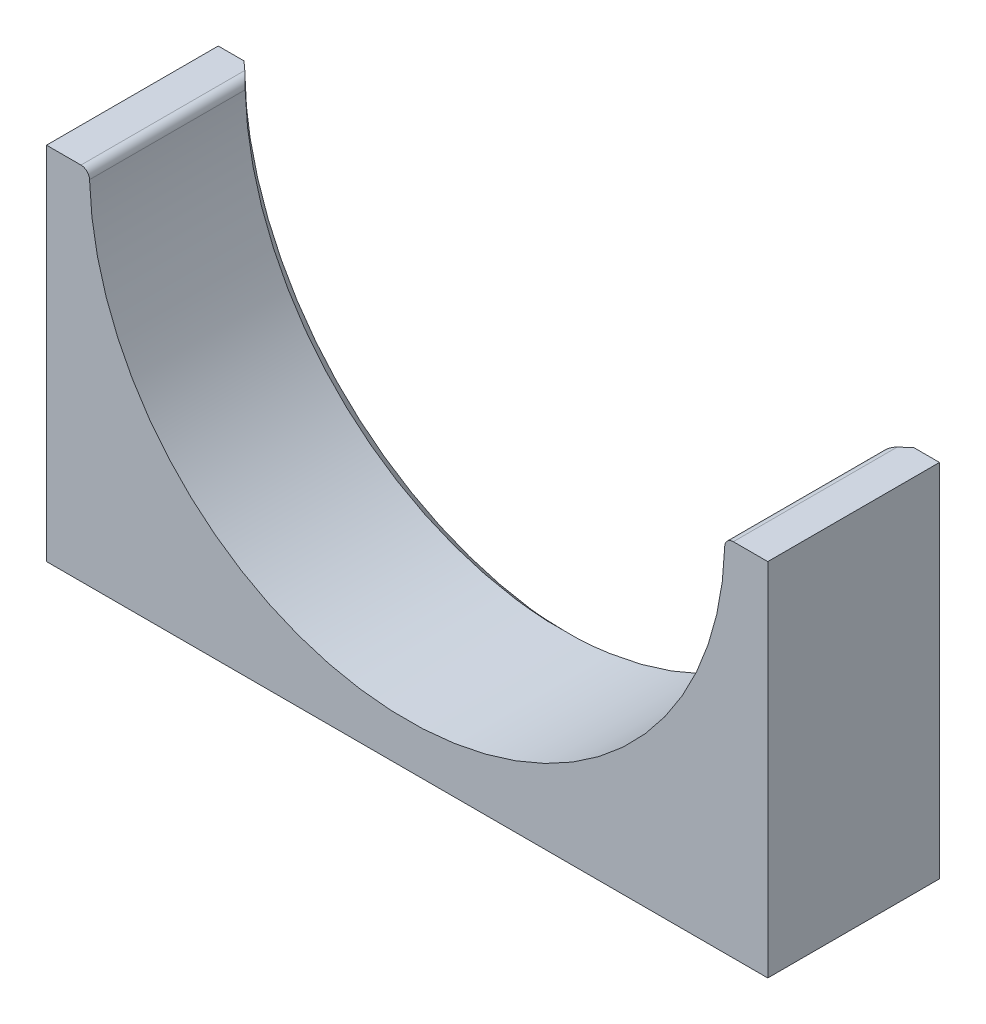
ISO-10303-21;
HEADER;
FILE_DESCRIPTION(('STEP AP214'),'2;1');
FILE_NAME('part.step','',(''),(''),'','','');
FILE_SCHEMA(('AUTOMOTIVE_DESIGN { 1 0 10303 214 1 1 1 1 }'));
ENDSEC;
DATA;
#1=APPLICATION_CONTEXT('core data for automotive mechanical design processes');
#2=APPLICATION_PROTOCOL_DEFINITION('international standard','automotive_design',2000,#1);
#3=PRODUCT_CONTEXT('',#1,'mechanical');
#4=PRODUCT('Part','Part','',(#3));
#5=PRODUCT_RELATED_PRODUCT_CATEGORY('part','',(#4));
#6=PRODUCT_DEFINITION_FORMATION('','',#4);
#7=PRODUCT_DEFINITION_CONTEXT('part definition',#1,'design');
#8=PRODUCT_DEFINITION('design','',#6,#7);
#9=PRODUCT_DEFINITION_SHAPE('','',#8);
#10=(LENGTH_UNIT() NAMED_UNIT(*) SI_UNIT(.MILLI.,.METRE.));
#11=(NAMED_UNIT(*) PLANE_ANGLE_UNIT() SI_UNIT($,.RADIAN.));
#12=(NAMED_UNIT(*) SI_UNIT($,.STERADIAN.) SOLID_ANGLE_UNIT());
#13=UNCERTAINTY_MEASURE_WITH_UNIT(LENGTH_MEASURE(1.E-05),#10,'distance_accuracy_value','');
#14=(GEOMETRIC_REPRESENTATION_CONTEXT(3) GLOBAL_UNCERTAINTY_ASSIGNED_CONTEXT((#13)) GLOBAL_UNIT_ASSIGNED_CONTEXT((#10,
#11,#12)) REPRESENTATION_CONTEXT('',''));
#15=CARTESIAN_POINT('',(0.,0.,0.));
#16=DIRECTION('',(0.,0.,1.));
#17=DIRECTION('',(1.,0.,0.));
#18=AXIS2_PLACEMENT_3D('',#15,#16,#17);
#19=CARTESIAN_POINT('',(106.68,-106.68,0.));
#20=DIRECTION('',(1.,0.,0.));
#21=DIRECTION('',(0.,0.,-1.));
#22=AXIS2_PLACEMENT_3D('',#19,#20,#21);
#23=PLANE('',#22);
#24=DIRECTION('',(0.,0.,-1.));
#25=VECTOR('',#24,1.);
#26=CARTESIAN_POINT('',(106.68,0.,0.));
#27=LINE('',#26,#25);
#28=CARTESIAN_POINT('',(106.68,0.,50.8));
#29=VERTEX_POINT('',#28);
#30=CARTESIAN_POINT('',(106.68,0.,0.));
#31=VERTEX_POINT('',#30);
#32=EDGE_CURVE('E115',#29,#31,#27,.T.);
#33=ORIENTED_EDGE('',*,*,#32,.F.);
#34=DIRECTION('',(0.,1.,0.));
#35=VECTOR('',#34,1.);
#36=CARTESIAN_POINT('',(106.68,-106.68,50.8));
#37=LINE('',#36,#35);
#38=CARTESIAN_POINT('',(106.68,-106.68,50.8));
#39=VERTEX_POINT('',#38);
#40=EDGE_CURVE('E127',#39,#29,#37,.T.);
#41=ORIENTED_EDGE('',*,*,#40,.F.);
#42=DIRECTION('',(0.,0.,1.));
#43=VECTOR('',#42,1.);
#44=CARTESIAN_POINT('',(106.68,-106.68,0.));
#45=LINE('',#44,#43);
#46=CARTESIAN_POINT('',(106.68,-106.68,0.));
#47=VERTEX_POINT('',#46);
#48=EDGE_CURVE('E148',#47,#39,#45,.T.);
#49=ORIENTED_EDGE('',*,*,#48,.F.);
#50=DIRECTION('',(0.,1.,0.));
#51=VECTOR('',#50,1.);
#52=CARTESIAN_POINT('',(106.68,-106.68,0.));
#53=LINE('',#52,#51);
#54=EDGE_CURVE('E130',#47,#31,#53,.T.);
#55=ORIENTED_EDGE('',*,*,#54,.T.);
#56=EDGE_LOOP('',(#33,#41,#49,#55));
#57=FACE_BOUND('',#56,.T.);
#58=ADVANCED_FACE('F40',(#57),#23,.T.);
#59=CARTESIAN_POINT('',(-106.68,-106.68,0.));
#60=DIRECTION('',(0.,-1.,0.));
#61=DIRECTION('',(0.,0.,-1.));
#62=AXIS2_PLACEMENT_3D('',#59,#60,#61);
#63=PLANE('',#62);
#64=DIRECTION('',(1.,0.,0.));
#65=VECTOR('',#64,1.);
#66=CARTESIAN_POINT('',(-106.68,-106.68,50.8));
#67=LINE('',#66,#65);
#68=CARTESIAN_POINT('',(-106.68,-106.68,50.8));
#69=VERTEX_POINT('',#68);
#70=EDGE_CURVE('E135',#69,#39,#67,.T.);
#71=ORIENTED_EDGE('',*,*,#70,.F.);
#72=DIRECTION('',(0.,0.,1.));
#73=VECTOR('',#72,1.);
#74=CARTESIAN_POINT('',(-106.68,-106.68,0.));
#75=LINE('',#74,#73);
#76=CARTESIAN_POINT('',(-106.68,-106.68,0.));
#77=VERTEX_POINT('',#76);
#78=EDGE_CURVE('E151',#77,#69,#75,.T.);
#79=ORIENTED_EDGE('',*,*,#78,.F.);
#80=DIRECTION('',(1.,0.,0.));
#81=VECTOR('',#80,1.);
#82=CARTESIAN_POINT('',(-106.68,-106.68,0.));
#83=LINE('',#82,#81);
#84=EDGE_CURVE('E144',#77,#47,#83,.T.);
#85=ORIENTED_EDGE('',*,*,#84,.T.);
#86=ORIENTED_EDGE('',*,*,#48,.T.);
#87=EDGE_LOOP('',(#71,#79,#85,#86));
#88=FACE_BOUND('',#87,.T.);
#89=ADVANCED_FACE('F188',(#88),#63,.T.);
#90=CARTESIAN_POINT('',(-106.68,-106.68,0.));
#91=DIRECTION('',(-1.,0.,0.));
#92=DIRECTION('',(0.,0.,1.));
#93=AXIS2_PLACEMENT_3D('',#90,#91,#92);
#94=PLANE('',#93);
#95=DIRECTION('',(0.,0.,1.));
#96=VECTOR('',#95,1.);
#97=CARTESIAN_POINT('',(-106.68,0.,0.));
#98=LINE('',#97,#96);
#99=CARTESIAN_POINT('',(-106.68,0.,0.));
#100=VERTEX_POINT('',#99);
#101=CARTESIAN_POINT('',(-106.68,0.,50.8));
#102=VERTEX_POINT('',#101);
#103=EDGE_CURVE('E240',#100,#102,#98,.T.);
#104=ORIENTED_EDGE('',*,*,#103,.F.);
#105=DIRECTION('',(0.,-1.,0.));
#106=VECTOR('',#105,1.);
#107=CARTESIAN_POINT('',(-106.68,-106.68,0.));
#108=LINE('',#107,#106);
#109=EDGE_CURVE('E245',#100,#77,#108,.T.);
#110=ORIENTED_EDGE('',*,*,#109,.T.);
#111=ORIENTED_EDGE('',*,*,#78,.T.);
#112=DIRECTION('',(0.,-1.,0.));
#113=VECTOR('',#112,1.);
#114=CARTESIAN_POINT('',(-106.68,-106.68,50.8));
#115=LINE('',#114,#113);
#116=EDGE_CURVE('E136',#102,#69,#115,.T.);
#117=ORIENTED_EDGE('',*,*,#116,.F.);
#118=EDGE_LOOP('',(#104,#110,#111,#117));
#119=FACE_BOUND('',#118,.T.);
#120=ADVANCED_FACE('F184',(#119),#94,.T.);
#121=CARTESIAN_POINT('',(0.,0.,0.));
#122=DIRECTION('',(0.,0.,-1.));
#123=DIRECTION('',(-1.,0.,0.));
#124=AXIS2_PLACEMENT_3D('',#121,#122,#123);
#125=PLANE('',#124);
#126=DIRECTION('',(-1.,0.,0.));
#127=VECTOR('',#126,1.);
#128=CARTESIAN_POINT('',(0.,0.,0.));
#129=LINE('',#128,#127);
#130=CARTESIAN_POINT('',(99.060000898988,8.4741096414025E-12,0.));
#131=VERTEX_POINT('',#130);
#132=EDGE_CURVE('E121',#31,#131,#129,.T.);
#133=ORIENTED_EDGE('',*,*,#132,.F.);
#134=ORIENTED_EDGE('',*,*,#54,.F.);
#135=ORIENTED_EDGE('',*,*,#84,.F.);
#136=ORIENTED_EDGE('',*,*,#109,.F.);
#137=CARTESIAN_POINT('',(-99.06,0.,0.));
#138=VERTEX_POINT('',#137);
#139=EDGE_CURVE('E256',#138,#100,#129,.T.);
#140=ORIENTED_EDGE('',*,*,#139,.F.);
#141=CARTESIAN_POINT('',(0.,0.,0.));
#142=DIRECTION('',(0.,0.,1.));
#143=DIRECTION('',(1.,0.,0.));
#144=AXIS2_PLACEMENT_3D('',#141,#142,#143);
#145=CIRCLE('',#144,99.06);
#146=EDGE_CURVE('E156',#138,#131,#145,.T.);
#147=ORIENTED_EDGE('',*,*,#146,.T.);
#148=EDGE_LOOP('',(#133,#134,#135,#136,#140,#147));
#149=FACE_BOUND('',#148,.T.);
#150=ADVANCED_FACE('F174',(#149),#125,.T.);
#151=CARTESIAN_POINT('',(0.,0.,50.8));
#152=DIRECTION('',(0.,0.,-1.));
#153=DIRECTION('',(-1.,0.,0.));
#154=AXIS2_PLACEMENT_3D('',#151,#152,#153);
#155=PLANE('',#154);
#156=CARTESIAN_POINT('',(0.,0.,50.8));
#157=DIRECTION('',(0.,0.,1.));
#158=DIRECTION('',(1.,0.,0.));
#159=AXIS2_PLACEMENT_3D('',#156,#157,#158);
#160=CIRCLE('',#159,93.98);
#161=CARTESIAN_POINT('',(-93.9474528128767,-2.47315789473684,50.8));
#162=VERTEX_POINT('',#161);
#163=CARTESIAN_POINT('',(93.9474528128767,-2.47315789473684,50.8));
#164=VERTEX_POINT('',#163);
#165=EDGE_CURVE('E137',#162,#164,#160,.T.);
#166=ORIENTED_EDGE('',*,*,#165,.F.);
#167=CARTESIAN_POINT('',(-96.4865731591707,-2.54,50.8));
#168=DIRECTION('',(0.,0.,-1.));
#169=DIRECTION('',(-1.,0.,0.));
#170=AXIS2_PLACEMENT_3D('',#167,#168,#169);
#171=CIRCLE('',#170,2.54);
#172=CARTESIAN_POINT('',(-96.4865731591707,0.,50.8));
#173=VERTEX_POINT('',#172);
#174=EDGE_CURVE('E262',#162,#173,#171,.F.);
#175=ORIENTED_EDGE('',*,*,#174,.T.);
#176=DIRECTION('',(-1.,0.,0.));
#177=VECTOR('',#176,1.);
#178=CARTESIAN_POINT('',(0.,0.,50.8));
#179=LINE('',#178,#177);
#180=EDGE_CURVE('E123',#173,#102,#179,.T.);
#181=ORIENTED_EDGE('',*,*,#180,.T.);
#182=ORIENTED_EDGE('',*,*,#116,.T.);
#183=ORIENTED_EDGE('',*,*,#70,.T.);
#184=ORIENTED_EDGE('',*,*,#40,.T.);
#185=CARTESIAN_POINT('',(96.4865731591707,0.,50.8));
#186=VERTEX_POINT('',#185);
#187=EDGE_CURVE('E111',#29,#186,#179,.T.);
#188=ORIENTED_EDGE('',*,*,#187,.T.);
#189=CARTESIAN_POINT('',(96.4865731591707,-2.54,50.8));
#190=DIRECTION('',(0.,0.,-1.));
#191=DIRECTION('',(-1.,0.,0.));
#192=AXIS2_PLACEMENT_3D('',#189,#190,#191);
#193=CIRCLE('',#192,2.54);
#194=EDGE_CURVE('E264',#186,#164,#193,.F.);
#195=ORIENTED_EDGE('',*,*,#194,.T.);
#196=EDGE_LOOP('',(#166,#175,#181,#182,#183,#184,#188,#195));
#197=FACE_BOUND('',#196,.T.);
#198=ADVANCED_FACE('F133',(#197),#155,.F.);
#199=CARTESIAN_POINT('',(0.,0.,0.));
#200=DIRECTION('',(0.,0.,1.));
#201=DIRECTION('',(1.,0.,0.));
#202=AXIS2_PLACEMENT_3D('',#199,#200,#201);
#203=CYLINDRICAL_SURFACE('',#202,93.98);
#204=CARTESIAN_POINT('',(0.,0.,4.77022595576423));
#205=DIRECTION('',(0.,0.,1.));
#206=DIRECTION('',(1.,0.,0.));
#207=AXIS2_PLACEMENT_3D('',#204,#205,#206);
#208=CIRCLE('',#207,93.98);
#209=CARTESIAN_POINT('',(93.9474528128767,-2.47315789473684,4.77022595576423));
#210=VERTEX_POINT('',#209);
#211=CARTESIAN_POINT('',(-93.9474528128767,-2.47315789473684,4.77022595576423));
#212=VERTEX_POINT('',#211);
#213=EDGE_CURVE('E141',#210,#212,#208,.F.);
#214=ORIENTED_EDGE('',*,*,#213,.T.);
#215=DIRECTION('',(0.,0.,1.));
#216=VECTOR('',#215,1.);
#217=CARTESIAN_POINT('',(-93.9474528128767,-2.47315789473684,0.));
#218=LINE('',#217,#216);
#219=EDGE_CURVE('E265',#212,#162,#218,.T.);
#220=ORIENTED_EDGE('',*,*,#219,.T.);
#221=ORIENTED_EDGE('',*,*,#165,.T.);
#222=DIRECTION('',(0.,0.,1.));
#223=VECTOR('',#222,1.);
#224=CARTESIAN_POINT('',(93.9474528128767,-2.47315789473684,0.));
#225=LINE('',#224,#223);
#226=EDGE_CURVE('E241',#164,#210,#225,.F.);
#227=ORIENTED_EDGE('',*,*,#226,.T.);
#228=EDGE_LOOP('',(#214,#220,#221,#227));
#229=FACE_BOUND('',#228,.T.);
#230=ADVANCED_FACE('F185',(#229),#203,.F.);
#231=CARTESIAN_POINT('',(-5.22583665885806,98.9220613979255,0.));
#232=CARTESIAN_POINT('',(82.0692055030363,45.7917668156667,50.8));
#233=CARTESIAN_POINT('',(-203.069959454709,88.4703880802093,0.));
#234=CARTESIAN_POINT('',(-9.51432812829715,209.930177821739,50.8));
#235=CARTESIAN_POINT('',(-192.618286136993,-109.373734715642,0.));
#236=CARTESIAN_POINT('',(-173.65273913437,118.346644190406,50.8));
#237=CARTESIAN_POINT('',(5.22583665885805,-98.9220613979255,0.));
#238=CARTESIAN_POINT('',(-82.0692055030363,-45.7917668156667,50.8));
#239=CARTESIAN_POINT('',(203.069959454709,-88.4703880802094,0.));
#240=CARTESIAN_POINT('',(9.51432812829715,-209.930177821739,50.8));
#241=CARTESIAN_POINT('',(192.618286136993,109.373734715642,0.));
#242=CARTESIAN_POINT('',(173.65273913437,-118.346644190406,50.8));
#243=CARTESIAN_POINT('',(-5.22583665885806,98.9220613979255,0.));
#244=CARTESIAN_POINT('',(82.0692055030363,45.7917668156667,50.8));
#245=(BOUNDED_SURFACE() B_SPLINE_SURFACE(3,1,((#231,#232),(#233,#234),(#235,#236),(#237,#238),
(#239,#240),(#241,#242),(#243,#244)),.UNSPECIFIED.,.T.,.F.,.F.) B_SPLINE_SURFACE_WITH_KNOTS((4,
3,4),(2,2),(0.,0.5,1.),(0.,1.),
.UNSPECIFIED.) GEOMETRIC_REPRESENTATION_ITEM() RATIONAL_B_SPLINE_SURFACE(((1.,1.),
(0.333333333333333,0.333333333333333),(0.333333333333333,0.333333333333333),(1.,1.),
(0.333333333333333,0.333333333333333),(0.333333333333333,0.333333333333333),(1.,1.))) REPRESENTATION_ITEM('') SURFACE());
#246=CARTESIAN_POINT('',(-99.06,0.,0.));
#247=CARTESIAN_POINT('',(-98.8420415564241,0.,0.192023565351599));
#248=CARTESIAN_POINT('',(-98.6247542611355,0.,0.384810081436057));
#249=CARTESIAN_POINT('',(-98.191641019553,0.,0.771931527221112));
#250=CARTESIAN_POINT('',(-97.9758147922164,0.,0.966266142524899));
#251=CARTESIAN_POINT('',(-97.5456871295782,0.,1.35655437710607));
#252=CARTESIAN_POINT('',(-97.3313854801418,0.,1.552507760316));
#253=CARTESIAN_POINT('',(-96.904376188475,0.,1.94610967369235));
#254=CARTESIAN_POINT('',(-96.6916684191595,0.,2.14375806595662));
#255=CARTESIAN_POINT('',(-96.2679132721635,0.,2.54083784763829));
#256=CARTESIAN_POINT('',(-96.0568659359386,0.,2.7402692813086));
#257=CARTESIAN_POINT('',(-95.6365205364005,0.,3.14099307641488));
#258=CARTESIAN_POINT('',(-95.4272225801195,0.,3.34228555015067));
#259=CARTESIAN_POINT('',(-95.0104629208144,0.,3.7468214264179));
#260=CARTESIAN_POINT('',(-94.8030014789203,0.,3.95006509808633));
#261=CARTESIAN_POINT('',(-94.3900106012508,0.,4.35860085026798));
#262=CARTESIAN_POINT('',(-94.1844816240633,0.,4.56389339429799));
#263=CARTESIAN_POINT('',(-93.98,0.,4.77022595576423));
#264=B_SPLINE_CURVE_WITH_KNOTS('',3,(#246,#247,#248,#249,#250,#251,#252,#253,#254,#255,#256,
#257,#258,#259,#260,#261,#262,#263),.UNSPECIFIED.,.F.,.F.,(4,2,2,2,2,2,2,2,4),(0.,
0.871440911790066,1.742709142632,2.61385248247416,3.48492560799787,4.35602041284292,
5.2271681293328,6.0984377845629,6.96990922896814),.UNSPECIFIED.);
#265=CARTESIAN_POINT('',(-96.4865731591707,0.,2.33594315915091));
#266=VERTEX_POINT('',#265);
#267=EDGE_CURVE('E238',#138,#266,#264,.T.);
#268=CARTESIAN_POINT('',(-96.4865731591707,0.,2.33594315915092));
#269=CARTESIAN_POINT('',(-96.3907783816814,-2.28734198966048E-05,2.4256863367287));
#270=CARTESIAN_POINT('',(-96.2951557438185,-0.0054204631764299,2.51561959757531));
#271=CARTESIAN_POINT('',(-96.1048050487047,-0.0270198857876057,2.69532843631234));
#272=CARTESIAN_POINT('',(-96.0100780027566,-0.0432327268632509,2.78510376000471));
#273=CARTESIAN_POINT('',(-95.82142662309,-0.0867112280092524,2.96457256375114));
#274=CARTESIAN_POINT('',(-95.7275170525504,-0.114074473477392,3.05425812613927));
#275=CARTESIAN_POINT('',(-95.5421671763655,-0.180048708924797,3.23191646792834));
#276=CARTESIAN_POINT('',(-95.4507256393181,-0.218653972050118,3.31989009513243));
#277=CARTESIAN_POINT('',(-95.228172826037,-0.328672477694684,3.53472248905243));
#278=CARTESIAN_POINT('',(-95.0989425252194,-0.406951492065627,3.66011496173031));
#279=CARTESIAN_POINT('',(-94.8513966790954,-0.590275246293499,3.901204769233));
#280=CARTESIAN_POINT('',(-94.7330468498244,-0.695231694108387,4.01693244392788));
#281=CARTESIAN_POINT('',(-94.5427887194575,-0.90075882838026,4.20320576014691));
#282=CARTESIAN_POINT('',(-94.4670929117637,-0.994502611456122,4.27739118243087));
#283=CARTESIAN_POINT('',(-94.3268837415952,-1.19742865543148,4.41458235847555));
#284=CARTESIAN_POINT('',(-94.2623585958944,-1.30659442509418,4.47759989421689));
#285=CARTESIAN_POINT('',(-94.1599755272071,-1.51570466255616,4.5769383728503));
#286=CARTESIAN_POINT('',(-94.119362463698,-1.61294669783869,4.61608392750956));
#287=CARTESIAN_POINT('',(-94.0498143344169,-1.8153035925336,4.68226696532161));
#288=CARTESIAN_POINT('',(-94.0208522919404,-1.92039958944052,4.70933243474053));
#289=CARTESIAN_POINT('',(-93.9837881747674,-2.10052418485804,4.74275839186404));
#290=CARTESIAN_POINT('',(-93.9719587380808,-2.17408404923659,4.75300012445085));
#291=CARTESIAN_POINT('',(-93.9590740429289,-2.28553245291593,4.76330435891457));
#292=CARTESIAN_POINT('',(-93.9555874502478,-2.32292512996336,4.76589611518262));
#293=CARTESIAN_POINT('',(-93.9502707809998,-2.3979210806584,4.76935845340214));
#294=CARTESIAN_POINT('',(-93.9484413153444,-2.43552442683455,4.77022840073645));
#295=CARTESIAN_POINT('',(-93.9474528128768,-2.47315789473685,4.77022595576424));
#296=B_SPLINE_CURVE_WITH_KNOTS('',3,(#268,#269,#270,#271,#272,#273,#274,#275,#276,#277,#278,
#279,#280,#281,#282,#283,#284,#285,#286,#287,#288,#289,#290,#291,#292,#293,#294,#295),
.UNSPECIFIED.,.F.,.F.,(4,2,2,2,2,2,2,2,2,2,2,2,2,4),(0.,0.393691183311433,0.787783694854728,
1.18540191939596,1.58281794447385,2.16978336088005,2.75483088320148,3.1779448337119,
3.60060971197725,3.93656756447468,4.27174300205018,4.49677265923884,4.60963563127643,
4.72254019413725),.UNSPECIFIED.);
#297=EDGE_CURVE('E49',#266,#212,#296,.T.);
#298=CARTESIAN_POINT('',(93.9474528128767,-2.47315789473684,4.77022595576423));
#299=CARTESIAN_POINT('',(93.9489291401898,-2.41651911682494,4.77024218393827));
#300=CARTESIAN_POINT('',(93.9523290599421,-2.35994312111087,4.76826189081975));
#301=CARTESIAN_POINT('',(93.9628484133792,-2.24745641307316,4.76043328936199));
#302=CARTESIAN_POINT('',(93.9699645789687,-2.19154516028355,4.75458837839779));
#303=CARTESIAN_POINT('',(93.9877104386483,-2.08133167085285,4.73922558560946));
#304=CARTESIAN_POINT('',(93.9983074772912,-2.02701940710691,4.72974170836603));
#305=CARTESIAN_POINT('',(94.0228194227348,-1.9198858562407,4.70732000686794));
#306=CARTESIAN_POINT('',(94.036734877778,-1.86706481710315,4.69438161184296));
#307=CARTESIAN_POINT('',(94.0830007413739,-1.71171423567033,4.65085893163281));
#308=CARTESIAN_POINT('',(94.1199488683891,-1.61182945713453,4.6154986834326));
#309=CARTESIAN_POINT('',(94.2040026290788,-1.42088262943083,4.53431734624686));
#310=CARTESIAN_POINT('',(94.2511333277324,-1.32984316990191,4.48847042707676));
#311=CARTESIAN_POINT('',(94.3759005534837,-1.11963986223858,4.36670398851872));
#312=CARTESIAN_POINT('',(94.4578658573818,-1.00557987745164,4.28639973708225));
#313=CARTESIAN_POINT('',(94.6337293162669,-0.797232154888076,4.11415452586312));
#314=CARTESIAN_POINT('',(94.7276504756688,-0.702983488580931,4.0221911340007));
#315=CARTESIAN_POINT('',(94.9614639032409,-0.500938167908489,3.79385283366979));
#316=CARTESIAN_POINT('',(95.1052325718967,-0.401672116667926,3.65391155073541));
#317=CARTESIAN_POINT('',(95.4030688562071,-0.236375634609102,3.36565026919413));
#318=CARTESIAN_POINT('',(95.557151569847,-0.170395188969929,3.2173180391234));
#319=CARTESIAN_POINT('',(95.8405567685684,-0.0799606386701698,2.94624295942536));
#320=CARTESIAN_POINT('',(95.968793307193,-0.0498934552733968,2.82420092906747));
#321=CARTESIAN_POINT('',(96.1624414085361,-0.0199256720264858,2.64087877685973));
#322=CARTESIAN_POINT('',(96.2270327028884,-0.0124585234292448,2.57989087722398));
#323=CARTESIAN_POINT('',(96.3565765625072,-0.00249844768752199,2.45789198706339));
#324=CARTESIAN_POINT('',(96.4215291289541,-5.53680555431266E-06,2.39688099646371));
#325=CARTESIAN_POINT('',(96.4865731591707,0.,2.3359431591509));
#326=B_SPLINE_CURVE_WITH_KNOTS('',3,(#298,#299,#300,#301,#302,#303,#304,#305,#306,#307,#308,
#309,#310,#311,#312,#313,#314,#315,#316,#317,#318,#319,#320,#321,#322,#323,#324,#325),
.UNSPECIFIED.,.F.,.F.,(4,2,2,2,2,2,2,2,2,2,2,2,2,4),(0.,0.16988757443849,0.339625999386691,
0.507815469529214,0.676032745875542,1.01104920888532,1.34689992569336,1.82957292463732,
2.31318909060348,2.98115557737312,3.65012218923543,4.18760227381058,4.45492303214249,
4.72224466443755),.UNSPECIFIED.);
#327=CARTESIAN_POINT('',(96.4865731591707,0.,2.33594315915089));
#328=VERTEX_POINT('',#327);
#329=EDGE_CURVE('E56',#210,#328,#326,.T.);
#330=CARTESIAN_POINT('',(93.98,0.,4.77022595576422));
#331=CARTESIAN_POINT('',(94.1844816240634,0.,4.56389339429798));
#332=CARTESIAN_POINT('',(94.3900106012509,0.,4.35860085026797));
#333=CARTESIAN_POINT('',(94.8030014789203,0.,3.95006509808631));
#334=CARTESIAN_POINT('',(95.0104629208144,0.,3.74682142641787));
#335=CARTESIAN_POINT('',(95.4272225801195,0.,3.34228555015063));
#336=CARTESIAN_POINT('',(95.6365205364005,0.,3.14099307641486));
#337=CARTESIAN_POINT('',(96.0568659359386,0.,2.74026928130858));
#338=CARTESIAN_POINT('',(96.2679132721635,0.,2.54083784763825));
#339=CARTESIAN_POINT('',(96.6916684191595,0.,2.14375806595659));
#340=CARTESIAN_POINT('',(96.9043761884749,0.,1.94610967369234));
#341=CARTESIAN_POINT('',(97.3313854801418,0.,1.552507760316));
#342=CARTESIAN_POINT('',(97.5456871295782,0.,1.35655437710608));
#343=CARTESIAN_POINT('',(97.9758147922163,0.,0.966266142524903));
#344=CARTESIAN_POINT('',(98.1916410195529,0.,0.771931527221111));
#345=CARTESIAN_POINT('',(98.6247542611355,0.,0.384810081436048));
#346=CARTESIAN_POINT('',(98.842041556424,0.,0.192023565351587));
#347=CARTESIAN_POINT('',(99.06,0.,0.));
#348=B_SPLINE_CURVE_WITH_KNOTS('',3,(#330,#331,#332,#333,#334,#335,#336,#337,#338,#339,#340,
#341,#342,#343,#344,#345,#346,#347),.UNSPECIFIED.,.F.,.F.,(4,2,2,2,2,2,2,2,4),(0.,
0.87147144440522,1.74274109963534,2.6138888161252,3.48498362097025,4.35605674649394,
5.22720008633611,6.09846831717803,6.96990922896811),.UNSPECIFIED.);
#349=EDGE_CURVE('E150',#328,#131,#348,.T.);
#350=ORIENTED_EDGE('',*,*,#267,.T.);
#351=ORIENTED_EDGE('',*,*,#297,.T.);
#352=ORIENTED_EDGE('',*,*,#213,.F.);
#353=ORIENTED_EDGE('',*,*,#329,.T.);
#354=ORIENTED_EDGE('',*,*,#349,.T.);
#355=ORIENTED_EDGE('',*,*,#146,.F.);
#356=EDGE_LOOP('',(#350,#351,#352,#353,#354,#355));
#357=FACE_BOUND('',#356,.T.);
#358=ADVANCED_FACE('F211',(#357),#245,.F.);
#359=CARTESIAN_POINT('',(0.,0.,0.));
#360=DIRECTION('',(0.,-1.,0.));
#361=DIRECTION('',(0.,0.,-1.));
#362=AXIS2_PLACEMENT_3D('',#359,#360,#361);
#363=PLANE('',#362);
#364=ORIENTED_EDGE('',*,*,#349,.F.);
#365=DIRECTION('',(0.,0.,1.));
#366=VECTOR('',#365,1.);
#367=CARTESIAN_POINT('',(96.4865731591707,0.,0.));
#368=LINE('',#367,#366);
#369=EDGE_CURVE('E12',#328,#186,#368,.T.);
#370=ORIENTED_EDGE('',*,*,#369,.T.);
#371=ORIENTED_EDGE('',*,*,#187,.F.);
#372=ORIENTED_EDGE('',*,*,#32,.T.);
#373=ORIENTED_EDGE('',*,*,#132,.T.);
#374=EDGE_LOOP('',(#364,#370,#371,#372,#373));
#375=FACE_BOUND('',#374,.T.);
#376=ADVANCED_FACE('F113',(#375),#363,.F.);
#377=ORIENTED_EDGE('',*,*,#180,.F.);
#378=DIRECTION('',(0.,0.,1.));
#379=VECTOR('',#378,1.);
#380=CARTESIAN_POINT('',(-96.4865731591707,0.,0.));
#381=LINE('',#380,#379);
#382=EDGE_CURVE('E64',#173,#266,#381,.F.);
#383=ORIENTED_EDGE('',*,*,#382,.T.);
#384=ORIENTED_EDGE('',*,*,#267,.F.);
#385=ORIENTED_EDGE('',*,*,#139,.T.);
#386=ORIENTED_EDGE('',*,*,#103,.T.);
#387=EDGE_LOOP('',(#377,#383,#384,#385,#386));
#388=FACE_BOUND('',#387,.T.);
#389=ADVANCED_FACE('F199',(#388),#363,.F.);
#390=CARTESIAN_POINT('',(-96.4865731591707,-2.54,0.));
#391=DIRECTION('',(0.,0.,1.));
#392=DIRECTION('',(1.,0.,0.));
#393=AXIS2_PLACEMENT_3D('',#390,#391,#392);
#394=CYLINDRICAL_SURFACE('',#393,2.54);
#395=ORIENTED_EDGE('',*,*,#297,.F.);
#396=ORIENTED_EDGE('',*,*,#382,.F.);
#397=ORIENTED_EDGE('',*,*,#174,.F.);
#398=ORIENTED_EDGE('',*,*,#219,.F.);
#399=EDGE_LOOP('',(#395,#396,#397,#398));
#400=FACE_BOUND('',#399,.T.);
#401=ADVANCED_FACE('F196',(#400),#394,.T.);
#402=CARTESIAN_POINT('',(96.4865731591707,-2.54,0.));
#403=DIRECTION('',(0.,0.,1.));
#404=DIRECTION('',(1.,0.,0.));
#405=AXIS2_PLACEMENT_3D('',#402,#403,#404);
#406=CYLINDRICAL_SURFACE('',#405,2.54);
#407=ORIENTED_EDGE('',*,*,#194,.F.);
#408=ORIENTED_EDGE('',*,*,#369,.F.);
#409=ORIENTED_EDGE('',*,*,#329,.F.);
#410=ORIENTED_EDGE('',*,*,#226,.F.);
#411=EDGE_LOOP('',(#407,#408,#409,#410));
#412=FACE_BOUND('',#411,.T.);
#413=ADVANCED_FACE('F42',(#412),#406,.T.);
#414=CLOSED_SHELL('',(#58,#89,#120,#150,#198,#230,#358,#376,#389,#401,#413));
#415=MANIFOLD_SOLID_BREP('B2',#414);
#416=ADVANCED_BREP_SHAPE_REPRESENTATION('',(#18,#415),#14);
#417=SHAPE_DEFINITION_REPRESENTATION(#9,#416);
ENDSEC;
END-ISO-10303-21;
